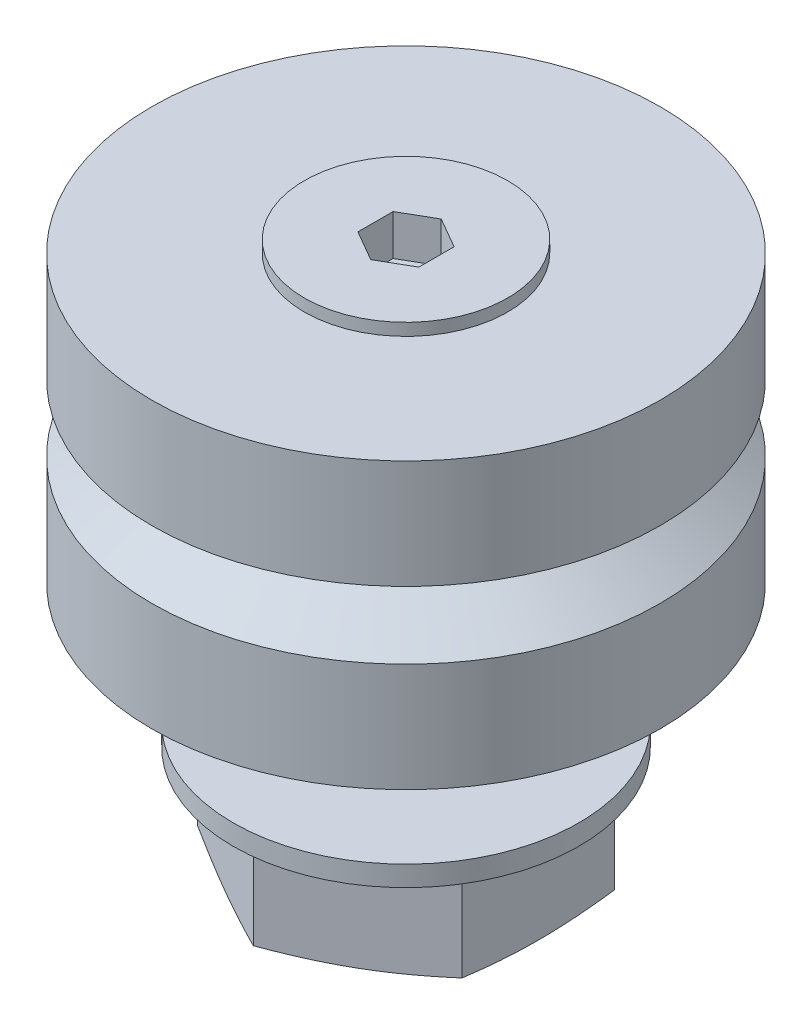
ISO-10303-21;
HEADER;
FILE_DESCRIPTION(('STEP AP214'),'2;1');
FILE_NAME('part.step','',(''),(''),'','','');
FILE_SCHEMA(('AUTOMOTIVE_DESIGN { 1 0 10303 214 1 1 1 1 }'));
ENDSEC;
DATA;
#1=APPLICATION_CONTEXT('core data for automotive mechanical design processes');
#2=APPLICATION_PROTOCOL_DEFINITION('international standard','automotive_design',2000,#1);
#3=PRODUCT_CONTEXT('',#1,'mechanical');
#4=PRODUCT('Part','Part','',(#3));
#5=PRODUCT_RELATED_PRODUCT_CATEGORY('part','',(#4));
#6=PRODUCT_DEFINITION_FORMATION('','',#4);
#7=PRODUCT_DEFINITION_CONTEXT('part definition',#1,'design');
#8=PRODUCT_DEFINITION('design','',#6,#7);
#9=PRODUCT_DEFINITION_SHAPE('','',#8);
#10=(LENGTH_UNIT() NAMED_UNIT(*) SI_UNIT(.MILLI.,.METRE.));
#11=(NAMED_UNIT(*) PLANE_ANGLE_UNIT() SI_UNIT($,.RADIAN.));
#12=(NAMED_UNIT(*) SI_UNIT($,.STERADIAN.) SOLID_ANGLE_UNIT());
#13=UNCERTAINTY_MEASURE_WITH_UNIT(LENGTH_MEASURE(1.E-05),#10,'distance_accuracy_value','');
#14=(GEOMETRIC_REPRESENTATION_CONTEXT(3) GLOBAL_UNCERTAINTY_ASSIGNED_CONTEXT((#13)) GLOBAL_UNIT_ASSIGNED_CONTEXT((#10,
#11,#12)) REPRESENTATION_CONTEXT('',''));
#15=CARTESIAN_POINT('',(0.,0.,0.));
#16=DIRECTION('',(0.,0.,1.));
#17=DIRECTION('',(1.,0.,0.));
#18=AXIS2_PLACEMENT_3D('',#15,#16,#17);
#19=CARTESIAN_POINT('',(-6.5,0.,3.7527767497326));
#20=DIRECTION('',(-1.,0.,0.));
#21=DIRECTION('',(0.,1.,0.));
#22=AXIS2_PLACEMENT_3D('',#19,#20,#21);
#23=PLANE('',#22);
#24=DIRECTION('',(0.,0.,-1.));
#25=VECTOR('',#24,1.);
#26=CARTESIAN_POINT('',(-6.5,2.,3.7527767497326));
#27=LINE('',#26,#25);
#28=CARTESIAN_POINT('',(-6.5,2.,-3.7527767497326));
#29=VERTEX_POINT('',#28);
#30=CARTESIAN_POINT('',(-6.5,2.,3.7527767497326));
#31=VERTEX_POINT('',#30);
#32=EDGE_CURVE('E162',#29,#31,#27,.F.);
#33=ORIENTED_EDGE('',*,*,#32,.F.);
#34=DIRECTION('',(0.,-1.,0.));
#35=VECTOR('',#34,1.);
#36=CARTESIAN_POINT('',(-6.5,2.,-3.7527767497326));
#37=LINE('',#36,#35);
#38=CARTESIAN_POINT('',(-6.5,0.,-3.7527767497326));
#39=VERTEX_POINT('',#38);
#40=EDGE_CURVE('E177',#29,#39,#37,.T.);
#41=ORIENTED_EDGE('',*,*,#40,.T.);
#42=DIRECTION('',(0.,0.,1.));
#43=VECTOR('',#42,1.);
#44=CARTESIAN_POINT('',(-6.5,0.,-3.7527767497326));
#45=LINE('',#44,#43);
#46=CARTESIAN_POINT('',(-6.5,0.,3.7527767497326));
#47=VERTEX_POINT('',#46);
#48=EDGE_CURVE('E183',#39,#47,#45,.T.);
#49=ORIENTED_EDGE('',*,*,#48,.T.);
#50=DIRECTION('',(0.,1.,0.));
#51=VECTOR('',#50,1.);
#52=CARTESIAN_POINT('',(-6.5,0.,3.7527767497326));
#53=LINE('',#52,#51);
#54=EDGE_CURVE('E179',#31,#47,#53,.F.);
#55=ORIENTED_EDGE('',*,*,#54,.F.);
#56=EDGE_LOOP('',(#33,#41,#49,#55));
#57=FACE_BOUND('',#56,.T.);
#58=ADVANCED_FACE('F17',(#57),#23,.T.);
#59=CARTESIAN_POINT('',(0.,0.,7.5055534994651));
#60=DIRECTION('',(-0.499999999999993,0.,0.866025403784443));
#61=DIRECTION('',(0.,1.,0.));
#62=AXIS2_PLACEMENT_3D('',#59,#60,#61);
#63=PLANE('',#62);
#64=DIRECTION('',(-0.866025403784443,0.,-0.499999999999993));
#65=VECTOR('',#64,1.);
#66=CARTESIAN_POINT('',(0.,2.,7.5055534994651));
#67=LINE('',#66,#65);
#68=CARTESIAN_POINT('',(0.,2.,7.5055534994651));
#69=VERTEX_POINT('',#68);
#70=EDGE_CURVE('E194',#31,#69,#67,.F.);
#71=ORIENTED_EDGE('',*,*,#70,.F.);
#72=ORIENTED_EDGE('',*,*,#54,.T.);
#73=DIRECTION('',(0.866025403784443,0.,0.499999999999993));
#74=VECTOR('',#73,1.);
#75=CARTESIAN_POINT('',(-6.5,0.,3.7527767497326));
#76=LINE('',#75,#74);
#77=CARTESIAN_POINT('',(0.,0.,7.5055534994651));
#78=VERTEX_POINT('',#77);
#79=EDGE_CURVE('E198',#47,#78,#76,.T.);
#80=ORIENTED_EDGE('',*,*,#79,.T.);
#81=DIRECTION('',(0.,1.,0.));
#82=VECTOR('',#81,1.);
#83=CARTESIAN_POINT('',(0.,0.,7.5055534994651));
#84=LINE('',#83,#82);
#85=EDGE_CURVE('E203',#69,#78,#84,.F.);
#86=ORIENTED_EDGE('',*,*,#85,.F.);
#87=EDGE_LOOP('',(#71,#72,#80,#86));
#88=FACE_BOUND('',#87,.T.);
#89=ADVANCED_FACE('F848',(#88),#63,.T.);
#90=CARTESIAN_POINT('',(6.5,0.,3.7527767497326));
#91=DIRECTION('',(0.499999999999993,0.,0.866025403784443));
#92=DIRECTION('',(0.,1.,0.));
#93=AXIS2_PLACEMENT_3D('',#90,#91,#92);
#94=PLANE('',#93);
#95=DIRECTION('',(-0.866025403784443,0.,0.499999999999993));
#96=VECTOR('',#95,1.);
#97=CARTESIAN_POINT('',(6.5,2.,3.7527767497326));
#98=LINE('',#97,#96);
#99=CARTESIAN_POINT('',(6.5,2.,3.7527767497326));
#100=VERTEX_POINT('',#99);
#101=EDGE_CURVE('E208',#69,#100,#98,.F.);
#102=ORIENTED_EDGE('',*,*,#101,.F.);
#103=ORIENTED_EDGE('',*,*,#85,.T.);
#104=DIRECTION('',(0.866025403784443,0.,-0.499999999999993));
#105=VECTOR('',#104,1.);
#106=CARTESIAN_POINT('',(0.,0.,7.5055534994651));
#107=LINE('',#106,#105);
#108=CARTESIAN_POINT('',(6.50000000000001,0.,3.7527767497326));
#109=VERTEX_POINT('',#108);
#110=EDGE_CURVE('E212',#78,#109,#107,.T.);
#111=ORIENTED_EDGE('',*,*,#110,.T.);
#112=DIRECTION('',(0.,1.,0.));
#113=VECTOR('',#112,1.);
#114=CARTESIAN_POINT('',(6.5,0.,3.7527767497326));
#115=LINE('',#114,#113);
#116=EDGE_CURVE('E217',#100,#109,#115,.F.);
#117=ORIENTED_EDGE('',*,*,#116,.F.);
#118=EDGE_LOOP('',(#102,#103,#111,#117));
#119=FACE_BOUND('',#118,.T.);
#120=ADVANCED_FACE('F853',(#119),#94,.T.);
#121=CARTESIAN_POINT('',(6.5,0.,-3.7527767497326));
#122=DIRECTION('',(1.,0.,0.));
#123=DIRECTION('',(0.,1.,0.));
#124=AXIS2_PLACEMENT_3D('',#121,#122,#123);
#125=PLANE('',#124);
#126=DIRECTION('',(0.,0.,1.));
#127=VECTOR('',#126,1.);
#128=CARTESIAN_POINT('',(6.5,2.,-3.7527767497326));
#129=LINE('',#128,#127);
#130=CARTESIAN_POINT('',(6.5,2.,-3.7527767497326));
#131=VERTEX_POINT('',#130);
#132=EDGE_CURVE('E222',#100,#131,#129,.F.);
#133=ORIENTED_EDGE('',*,*,#132,.F.);
#134=ORIENTED_EDGE('',*,*,#116,.T.);
#135=DIRECTION('',(0.,0.,-1.));
#136=VECTOR('',#135,1.);
#137=CARTESIAN_POINT('',(6.5,0.,3.7527767497326));
#138=LINE('',#137,#136);
#139=CARTESIAN_POINT('',(6.5,0.,-3.7527767497326));
#140=VERTEX_POINT('',#139);
#141=EDGE_CURVE('E226',#109,#140,#138,.T.);
#142=ORIENTED_EDGE('',*,*,#141,.T.);
#143=DIRECTION('',(0.,1.,0.));
#144=VECTOR('',#143,1.);
#145=CARTESIAN_POINT('',(6.5,0.,-3.7527767497326));
#146=LINE('',#145,#144);
#147=EDGE_CURVE('E231',#131,#140,#146,.F.);
#148=ORIENTED_EDGE('',*,*,#147,.F.);
#149=EDGE_LOOP('',(#133,#134,#142,#148));
#150=FACE_BOUND('',#149,.T.);
#151=ADVANCED_FACE('F859',(#150),#125,.T.);
#152=CARTESIAN_POINT('',(0.,0.,-7.5055534994651));
#153=DIRECTION('',(0.499999999999993,0.,-0.866025403784443));
#154=DIRECTION('',(0.,1.,0.));
#155=AXIS2_PLACEMENT_3D('',#152,#153,#154);
#156=PLANE('',#155);
#157=DIRECTION('',(0.866025403784443,0.,0.499999999999993));
#158=VECTOR('',#157,1.);
#159=CARTESIAN_POINT('',(0.,2.,-7.5055534994651));
#160=LINE('',#159,#158);
#161=CARTESIAN_POINT('',(0.,2.,-7.5055534994651));
#162=VERTEX_POINT('',#161);
#163=EDGE_CURVE('E165',#131,#162,#160,.F.);
#164=ORIENTED_EDGE('',*,*,#163,.F.);
#165=ORIENTED_EDGE('',*,*,#147,.T.);
#166=DIRECTION('',(-0.866025403784443,0.,-0.499999999999993));
#167=VECTOR('',#166,1.);
#168=CARTESIAN_POINT('',(6.5,0.,-3.7527767497326));
#169=LINE('',#168,#167);
#170=CARTESIAN_POINT('',(0.,0.,-7.5055534994651));
#171=VERTEX_POINT('',#170);
#172=EDGE_CURVE('E239',#140,#171,#169,.T.);
#173=ORIENTED_EDGE('',*,*,#172,.T.);
#174=DIRECTION('',(0.,1.,0.));
#175=VECTOR('',#174,1.);
#176=CARTESIAN_POINT('',(0.,0.,-7.5055534994651));
#177=LINE('',#176,#175);
#178=EDGE_CURVE('E171',#162,#171,#177,.F.);
#179=ORIENTED_EDGE('',*,*,#178,.F.);
#180=EDGE_LOOP('',(#164,#165,#173,#179));
#181=FACE_BOUND('',#180,.T.);
#182=ADVANCED_FACE('F863',(#181),#156,.T.);
#183=CARTESIAN_POINT('',(-6.5,0.,-3.7527767497326));
#184=DIRECTION('',(-0.499999999999993,0.,-0.866025403784443));
#185=DIRECTION('',(0.,1.,0.));
#186=AXIS2_PLACEMENT_3D('',#183,#184,#185);
#187=PLANE('',#186);
#188=DIRECTION('',(0.866025403784443,0.,-0.499999999999993));
#189=VECTOR('',#188,1.);
#190=CARTESIAN_POINT('',(-6.5,2.,-3.7527767497326));
#191=LINE('',#190,#189);
#192=EDGE_CURVE('E159',#162,#29,#191,.F.);
#193=ORIENTED_EDGE('',*,*,#192,.F.);
#194=ORIENTED_EDGE('',*,*,#178,.T.);
#195=DIRECTION('',(-0.866025403784443,0.,0.499999999999993));
#196=VECTOR('',#195,1.);
#197=CARTESIAN_POINT('',(0.,0.,-7.5055534994651));
#198=LINE('',#197,#196);
#199=EDGE_CURVE('E170',#171,#39,#198,.T.);
#200=ORIENTED_EDGE('',*,*,#199,.T.);
#201=ORIENTED_EDGE('',*,*,#40,.F.);
#202=EDGE_LOOP('',(#193,#194,#200,#201));
#203=FACE_BOUND('',#202,.T.);
#204=ADVANCED_FACE('F182',(#203),#187,.T.);
#205=CARTESIAN_POINT('',(-6.5,0.,-7.5055534994651));
#206=DIRECTION('',(0.,-1.,0.));
#207=DIRECTION('',(1.,0.,0.));
#208=AXIS2_PLACEMENT_3D('',#205,#206,#207);
#209=PLANE('',#208);
#210=ORIENTED_EDGE('',*,*,#48,.F.);
#211=ORIENTED_EDGE('',*,*,#199,.F.);
#212=ORIENTED_EDGE('',*,*,#172,.F.);
#213=ORIENTED_EDGE('',*,*,#141,.F.);
#214=ORIENTED_EDGE('',*,*,#110,.F.);
#215=ORIENTED_EDGE('',*,*,#79,.F.);
#216=EDGE_LOOP('',(#210,#211,#212,#213,#214,#215));
#217=FACE_BOUND('',#216,.T.);
#218=CARTESIAN_POINT('',(0.,0.,0.));
#219=DIRECTION('',(0.,1.,0.));
#220=DIRECTION('',(-1.4205389908817E-07,0.,-0.99999999999999));
#221=AXIS2_PLACEMENT_3D('',#218,#219,#220);
#222=CIRCLE('',#221,4.);
#223=CARTESIAN_POINT('',(-5.68215596352681E-07,0.,-3.99999999999996));
#224=VERTEX_POINT('',#223);
#225=EDGE_CURVE('E252',#224,#224,#222,.T.);
#226=ORIENTED_EDGE('',*,*,#225,.T.);
#227=EDGE_LOOP('',(#226));
#228=FACE_BOUND('',#227,.T.);
#229=ADVANCED_FACE('F870',(#217,#228),#209,.T.);
#230=CARTESIAN_POINT('',(-12.7322042750372,2.,-12.5));
#231=DIRECTION('',(0.,-1.,0.));
#232=DIRECTION('',(1.,0.,0.));
#233=AXIS2_PLACEMENT_3D('',#230,#231,#232);
#234=PLANE('',#233);
#235=CARTESIAN_POINT('',(0.,2.,0.));
#236=DIRECTION('',(0.,-1.,0.));
#237=DIRECTION('',(-1.16851708753529E-09,0.,1.));
#238=AXIS2_PLACEMENT_3D('',#235,#236,#237);
#239=CIRCLE('',#238,12.5);
#240=CARTESIAN_POINT('',(-1.46064635941911E-08,2.,12.5));
#241=VERTEX_POINT('',#240);
#242=EDGE_CURVE('E257',#241,#241,#239,.T.);
#243=ORIENTED_EDGE('',*,*,#242,.T.);
#244=EDGE_LOOP('',(#243));
#245=FACE_BOUND('',#244,.T.);
#246=ORIENTED_EDGE('',*,*,#132,.T.);
#247=ORIENTED_EDGE('',*,*,#163,.T.);
#248=ORIENTED_EDGE('',*,*,#192,.T.);
#249=ORIENTED_EDGE('',*,*,#32,.T.);
#250=ORIENTED_EDGE('',*,*,#70,.T.);
#251=ORIENTED_EDGE('',*,*,#101,.T.);
#252=EDGE_LOOP('',(#246,#247,#248,#249,#250,#251));
#253=FACE_BOUND('',#252,.T.);
#254=ADVANCED_FACE('F161',(#245,#253),#234,.T.);
#255=CARTESIAN_POINT('',(-5.,16.6,5.));
#256=DIRECTION('',(0.,1.,0.));
#257=DIRECTION('',(1.,0.,0.));
#258=AXIS2_PLACEMENT_3D('',#255,#256,#257);
#259=PLANE('',#258);
#260=CARTESIAN_POINT('',(0.,16.6,0.));
#261=DIRECTION('',(0.,1.,0.));
#262=DIRECTION('',(0.,0.,-1.));
#263=AXIS2_PLACEMENT_3D('',#260,#261,#262);
#264=CIRCLE('',#263,5.);
#265=CARTESIAN_POINT('',(0.,16.6,-5.));
#266=VERTEX_POINT('',#265);
#267=EDGE_CURVE('E260',#266,#266,#264,.F.);
#268=ORIENTED_EDGE('',*,*,#267,.F.);
#269=EDGE_LOOP('',(#268));
#270=FACE_BOUND('',#269,.T.);
#271=DIRECTION('',(-0.866025403784433,0.,0.500000000000009));
#272=VECTOR('',#271,1.);
#273=CARTESIAN_POINT('',(1.5,16.6,0.866025403784439));
#274=LINE('',#273,#272);
#275=CARTESIAN_POINT('',(0.,16.6,1.7320508075689));
#276=VERTEX_POINT('',#275);
#277=CARTESIAN_POINT('',(1.5,16.6,0.866025403784439));
#278=VERTEX_POINT('',#277);
#279=EDGE_CURVE('E263',#276,#278,#274,.F.);
#280=ORIENTED_EDGE('',*,*,#279,.F.);
#281=DIRECTION('',(-0.866025403784433,0.,-0.500000000000009));
#282=VECTOR('',#281,1.);
#283=CARTESIAN_POINT('',(0.,16.6,1.7320508075689));
#284=LINE('',#283,#282);
#285=CARTESIAN_POINT('',(-1.5,16.6,0.866025403784439));
#286=VERTEX_POINT('',#285);
#287=EDGE_CURVE('E266',#286,#276,#284,.F.);
#288=ORIENTED_EDGE('',*,*,#287,.F.);
#289=DIRECTION('',(0.,0.,-1.));
#290=VECTOR('',#289,1.);
#291=CARTESIAN_POINT('',(-1.5,16.6,0.866025403784439));
#292=LINE('',#291,#290);
#293=CARTESIAN_POINT('',(-1.5,16.6,-0.866025403784442));
#294=VERTEX_POINT('',#293);
#295=EDGE_CURVE('E271',#294,#286,#292,.F.);
#296=ORIENTED_EDGE('',*,*,#295,.F.);
#297=DIRECTION('',(0.866025403784434,0.,-0.500000000000008));
#298=VECTOR('',#297,1.);
#299=CARTESIAN_POINT('',(-1.5,16.6,-0.866025403784442));
#300=LINE('',#299,#298);
#301=CARTESIAN_POINT('',(0.,16.6,-1.7320508075689));
#302=VERTEX_POINT('',#301);
#303=EDGE_CURVE('E276',#302,#294,#300,.F.);
#304=ORIENTED_EDGE('',*,*,#303,.F.);
#305=DIRECTION('',(0.866025403784434,0.,0.500000000000008));
#306=VECTOR('',#305,1.);
#307=CARTESIAN_POINT('',(0.,16.6,-1.7320508075689));
#308=LINE('',#307,#306);
#309=CARTESIAN_POINT('',(1.5,16.6,-0.866025403784442));
#310=VERTEX_POINT('',#309);
#311=EDGE_CURVE('E280',#310,#302,#308,.F.);
#312=ORIENTED_EDGE('',*,*,#311,.F.);
#313=DIRECTION('',(0.,0.,1.));
#314=VECTOR('',#313,1.);
#315=CARTESIAN_POINT('',(1.5,16.6,-0.866025403784442));
#316=LINE('',#315,#314);
#317=EDGE_CURVE('E285',#310,#278,#316,.T.);
#318=ORIENTED_EDGE('',*,*,#317,.T.);
#319=EDGE_LOOP('',(#280,#288,#296,#304,#312,#318));
#320=FACE_BOUND('',#319,.T.);
#321=ADVANCED_FACE('F795',(#270,#320),#259,.T.);
#322=CARTESIAN_POINT('',(-12.7322042967848,16.,12.5));
#323=DIRECTION('',(0.,1.,0.));
#324=DIRECTION('',(1.,0.,0.));
#325=AXIS2_PLACEMENT_3D('',#322,#323,#324);
#326=PLANE('',#325);
#327=CARTESIAN_POINT('',(0.,16.,0.));
#328=DIRECTION('',(0.,1.,0.));
#329=DIRECTION('',(0.,0.,-1.));
#330=AXIS2_PLACEMENT_3D('',#327,#328,#329);
#331=CIRCLE('',#330,12.5);
#332=CARTESIAN_POINT('',(0.,16.,-12.5));
#333=VERTEX_POINT('',#332);
#334=EDGE_CURVE('E290',#333,#333,#331,.F.);
#335=ORIENTED_EDGE('',*,*,#334,.F.);
#336=EDGE_LOOP('',(#335));
#337=FACE_BOUND('',#336,.T.);
#338=CARTESIAN_POINT('',(0.,16.,0.));
#339=DIRECTION('',(0.,-1.,0.));
#340=DIRECTION('',(-1.42053902507657E-07,0.,0.99999999999999));
#341=AXIS2_PLACEMENT_3D('',#338,#339,#340);
#342=CIRCLE('',#341,5.);
#343=CARTESIAN_POINT('',(-7.10269512538286E-07,16.,4.99999999999995));
#344=VERTEX_POINT('',#343);
#345=EDGE_CURVE('E295',#344,#344,#342,.T.);
#346=ORIENTED_EDGE('',*,*,#345,.T.);
#347=EDGE_LOOP('',(#346));
#348=FACE_BOUND('',#347,.T.);
#349=ADVANCED_FACE('F791',(#337,#348),#326,.T.);
#350=CARTESIAN_POINT('',(-1.5,14.6,-0.866025403784441));
#351=DIRECTION('',(1.,0.,0.));
#352=DIRECTION('',(0.,1.,0.));
#353=AXIS2_PLACEMENT_3D('',#350,#351,#352);
#354=PLANE('',#353);
#355=ORIENTED_EDGE('',*,*,#295,.T.);
#356=DIRECTION('',(0.,-1.,0.));
#357=VECTOR('',#356,1.);
#358=CARTESIAN_POINT('',(-1.5,16.6,0.86602540378444));
#359=LINE('',#358,#357);
#360=CARTESIAN_POINT('',(-1.5,14.6,0.86602540378444));
#361=VERTEX_POINT('',#360);
#362=EDGE_CURVE('E298',#361,#286,#359,.F.);
#363=ORIENTED_EDGE('',*,*,#362,.F.);
#364=DIRECTION('',(0.,0.,-1.));
#365=VECTOR('',#364,1.);
#366=CARTESIAN_POINT('',(-1.5,14.6,0.86602540378444));
#367=LINE('',#366,#365);
#368=CARTESIAN_POINT('',(-1.5,14.6,-0.866025403784441));
#369=VERTEX_POINT('',#368);
#370=EDGE_CURVE('E300',#369,#361,#367,.F.);
#371=ORIENTED_EDGE('',*,*,#370,.F.);
#372=DIRECTION('',(0.,1.,0.));
#373=VECTOR('',#372,1.);
#374=CARTESIAN_POINT('',(-1.5,14.6,-0.866025403784441));
#375=LINE('',#374,#373);
#376=EDGE_CURVE('E304',#369,#294,#375,.T.);
#377=ORIENTED_EDGE('',*,*,#376,.T.);
#378=EDGE_LOOP('',(#355,#363,#371,#377));
#379=FACE_BOUND('',#378,.T.);
#380=ADVANCED_FACE('F794',(#379),#354,.T.);
#381=CARTESIAN_POINT('',(-1.5,14.6,0.86602540378444));
#382=DIRECTION('',(0.500000000000009,0.,-0.866025403784434));
#383=DIRECTION('',(0.,1.,0.));
#384=AXIS2_PLACEMENT_3D('',#381,#382,#383);
#385=PLANE('',#384);
#386=ORIENTED_EDGE('',*,*,#287,.T.);
#387=DIRECTION('',(0.,-1.,0.));
#388=VECTOR('',#387,1.);
#389=CARTESIAN_POINT('',(0.,16.6,1.7320508075689));
#390=LINE('',#389,#388);
#391=CARTESIAN_POINT('',(0.,14.6,1.7320508075689));
#392=VERTEX_POINT('',#391);
#393=EDGE_CURVE('E309',#392,#276,#390,.F.);
#394=ORIENTED_EDGE('',*,*,#393,.F.);
#395=DIRECTION('',(-0.866025403784434,0.,-0.500000000000009));
#396=VECTOR('',#395,1.);
#397=CARTESIAN_POINT('',(0.,14.6,1.7320508075689));
#398=LINE('',#397,#396);
#399=EDGE_CURVE('E313',#361,#392,#398,.F.);
#400=ORIENTED_EDGE('',*,*,#399,.F.);
#401=ORIENTED_EDGE('',*,*,#362,.T.);
#402=EDGE_LOOP('',(#386,#394,#400,#401));
#403=FACE_BOUND('',#402,.T.);
#404=ADVANCED_FACE('F815',(#403),#385,.T.);
#405=CARTESIAN_POINT('',(0.,14.6,1.7320508075689));
#406=DIRECTION('',(-0.500000000000009,0.,-0.866025403784434));
#407=DIRECTION('',(0.,1.,0.));
#408=AXIS2_PLACEMENT_3D('',#405,#406,#407);
#409=PLANE('',#408);
#410=ORIENTED_EDGE('',*,*,#279,.T.);
#411=DIRECTION('',(0.,-1.,0.));
#412=VECTOR('',#411,1.);
#413=CARTESIAN_POINT('',(1.5,16.6,0.866025403784441));
#414=LINE('',#413,#412);
#415=CARTESIAN_POINT('',(1.5,14.6,0.866025403784441));
#416=VERTEX_POINT('',#415);
#417=EDGE_CURVE('E317',#416,#278,#414,.F.);
#418=ORIENTED_EDGE('',*,*,#417,.F.);
#419=DIRECTION('',(-0.866025403784434,0.,0.500000000000009));
#420=VECTOR('',#419,1.);
#421=CARTESIAN_POINT('',(1.5,14.6,0.866025403784441));
#422=LINE('',#421,#420);
#423=EDGE_CURVE('E321',#392,#416,#422,.F.);
#424=ORIENTED_EDGE('',*,*,#423,.F.);
#425=ORIENTED_EDGE('',*,*,#393,.T.);
#426=EDGE_LOOP('',(#410,#418,#424,#425));
#427=FACE_BOUND('',#426,.T.);
#428=ADVANCED_FACE('F832',(#427),#409,.T.);
#429=CARTESIAN_POINT('',(1.5,14.6,0.86602540378444));
#430=DIRECTION('',(-1.,0.,0.));
#431=DIRECTION('',(0.,1.,0.));
#432=AXIS2_PLACEMENT_3D('',#429,#430,#431);
#433=PLANE('',#432);
#434=ORIENTED_EDGE('',*,*,#417,.T.);
#435=ORIENTED_EDGE('',*,*,#317,.F.);
#436=DIRECTION('',(0.,-1.,0.));
#437=VECTOR('',#436,1.);
#438=CARTESIAN_POINT('',(1.5,16.6,-0.866025403784441));
#439=LINE('',#438,#437);
#440=CARTESIAN_POINT('',(1.5,14.6,-0.866025403784441));
#441=VERTEX_POINT('',#440);
#442=EDGE_CURVE('E325',#441,#310,#439,.F.);
#443=ORIENTED_EDGE('',*,*,#442,.F.);
#444=DIRECTION('',(0.,0.,1.));
#445=VECTOR('',#444,1.);
#446=CARTESIAN_POINT('',(1.5,14.6,-0.866025403784441));
#447=LINE('',#446,#445);
#448=EDGE_CURVE('E329',#416,#441,#447,.F.);
#449=ORIENTED_EDGE('',*,*,#448,.F.);
#450=EDGE_LOOP('',(#434,#435,#443,#449));
#451=FACE_BOUND('',#450,.T.);
#452=ADVANCED_FACE('F830',(#451),#433,.T.);
#453=CARTESIAN_POINT('',(1.5,14.6,-0.86602540378444));
#454=DIRECTION('',(-0.500000000000009,0.,0.866025403784434));
#455=DIRECTION('',(0.,1.,0.));
#456=AXIS2_PLACEMENT_3D('',#453,#454,#455);
#457=PLANE('',#456);
#458=ORIENTED_EDGE('',*,*,#311,.T.);
#459=DIRECTION('',(0.,-1.,0.));
#460=VECTOR('',#459,1.);
#461=CARTESIAN_POINT('',(0.,16.6,-1.7320508075689));
#462=LINE('',#461,#460);
#463=CARTESIAN_POINT('',(0.,14.6,-1.7320508075689));
#464=VERTEX_POINT('',#463);
#465=EDGE_CURVE('E333',#464,#302,#462,.F.);
#466=ORIENTED_EDGE('',*,*,#465,.F.);
#467=DIRECTION('',(0.866025403784434,0.,0.500000000000009));
#468=VECTOR('',#467,1.);
#469=CARTESIAN_POINT('',(0.,14.6,-1.7320508075689));
#470=LINE('',#469,#468);
#471=EDGE_CURVE('E337',#441,#464,#470,.F.);
#472=ORIENTED_EDGE('',*,*,#471,.F.);
#473=ORIENTED_EDGE('',*,*,#442,.T.);
#474=EDGE_LOOP('',(#458,#466,#472,#473));
#475=FACE_BOUND('',#474,.T.);
#476=ADVANCED_FACE('F825',(#475),#457,.T.);
#477=CARTESIAN_POINT('',(0.,14.6,-1.7320508075689));
#478=DIRECTION('',(0.500000000000009,0.,0.866025403784434));
#479=DIRECTION('',(0.,1.,0.));
#480=AXIS2_PLACEMENT_3D('',#477,#478,#479);
#481=PLANE('',#480);
#482=ORIENTED_EDGE('',*,*,#303,.T.);
#483=ORIENTED_EDGE('',*,*,#376,.F.);
#484=DIRECTION('',(0.866025403784434,0.,-0.500000000000009));
#485=VECTOR('',#484,1.);
#486=CARTESIAN_POINT('',(-1.5,14.6,-0.866025403784441));
#487=LINE('',#486,#485);
#488=EDGE_CURVE('E341',#464,#369,#487,.F.);
#489=ORIENTED_EDGE('',*,*,#488,.F.);
#490=ORIENTED_EDGE('',*,*,#465,.T.);
#491=EDGE_LOOP('',(#482,#483,#489,#490));
#492=FACE_BOUND('',#491,.T.);
#493=ADVANCED_FACE('F836',(#492),#481,.T.);
#494=CARTESIAN_POINT('',(-1.5,14.6,-1.7320508075689));
#495=DIRECTION('',(0.,1.,0.));
#496=DIRECTION('',(0.,0.,1.));
#497=AXIS2_PLACEMENT_3D('',#494,#495,#496);
#498=PLANE('',#497);
#499=ORIENTED_EDGE('',*,*,#370,.T.);
#500=ORIENTED_EDGE('',*,*,#399,.T.);
#501=ORIENTED_EDGE('',*,*,#423,.T.);
#502=ORIENTED_EDGE('',*,*,#448,.T.);
#503=ORIENTED_EDGE('',*,*,#471,.T.);
#504=ORIENTED_EDGE('',*,*,#488,.T.);
#505=EDGE_LOOP('',(#499,#500,#501,#502,#503,#504));
#506=FACE_BOUND('',#505,.T.);
#507=ADVANCED_FACE('F834',(#506),#498,.T.);
#508=CARTESIAN_POINT('',(-8.73225364009987,-4.,8.5));
#509=DIRECTION('',(0.,1.,0.));
#510=DIRECTION('',(1.,0.,0.));
#511=AXIS2_PLACEMENT_3D('',#508,#509,#510);
#512=PLANE('',#511);
#513=CARTESIAN_POINT('',(0.,-4.,0.));
#514=DIRECTION('',(0.,1.,0.));
#515=DIRECTION('',(0.,0.,-1.));
#516=AXIS2_PLACEMENT_3D('',#513,#514,#515);
#517=CIRCLE('',#516,8.5);
#518=CARTESIAN_POINT('',(0.,-4.,-8.5));
#519=VERTEX_POINT('',#518);
#520=EDGE_CURVE('E345',#519,#519,#517,.F.);
#521=ORIENTED_EDGE('',*,*,#520,.F.);
#522=EDGE_LOOP('',(#521));
#523=FACE_BOUND('',#522,.T.);
#524=CARTESIAN_POINT('',(0.,-4.,0.));
#525=DIRECTION('',(0.,-1.,0.));
#526=DIRECTION('',(0.,0.,1.));
#527=AXIS2_PLACEMENT_3D('',#524,#525,#526);
#528=CIRCLE('',#527,4.);
#529=CARTESIAN_POINT('',(0.,-4.,4.));
#530=VERTEX_POINT('',#529);
#531=EDGE_CURVE('E350',#530,#530,#528,.T.);
#532=ORIENTED_EDGE('',*,*,#531,.T.);
#533=EDGE_LOOP('',(#532));
#534=FACE_BOUND('',#533,.T.);
#535=ADVANCED_FACE('F844',(#523,#534),#512,.T.);
#536=CARTESIAN_POINT('',(-8.73225362560406,-5.,-8.5));
#537=DIRECTION('',(0.,-1.,0.));
#538=DIRECTION('',(1.,0.,0.));
#539=AXIS2_PLACEMENT_3D('',#536,#537,#538);
#540=PLANE('',#539);
#541=CARTESIAN_POINT('',(0.,-5.,0.));
#542=DIRECTION('',(0.,-1.,0.));
#543=DIRECTION('',(-1.16842149027969E-09,0.,1.));
#544=AXIS2_PLACEMENT_3D('',#541,#542,#543);
#545=CIRCLE('',#544,8.5);
#546=CARTESIAN_POINT('',(-9.93158266737737E-09,-5.,8.5));
#547=VERTEX_POINT('',#546);
#548=EDGE_CURVE('E353',#547,#547,#545,.F.);
#549=ORIENTED_EDGE('',*,*,#548,.F.);
#550=EDGE_LOOP('',(#549));
#551=FACE_BOUND('',#550,.T.);
#552=DIRECTION('',(0.,0.,1.));
#553=VECTOR('',#552,1.);
#554=CARTESIAN_POINT('',(-6.5,-5.,-3.7527767497326));
#555=LINE('',#554,#553);
#556=CARTESIAN_POINT('',(-6.5,-5.,-3.7527767497326));
#557=VERTEX_POINT('',#556);
#558=CARTESIAN_POINT('',(-6.5,-5.,3.7527767497326));
#559=VERTEX_POINT('',#558);
#560=EDGE_CURVE('E356',#557,#559,#555,.T.);
#561=ORIENTED_EDGE('',*,*,#560,.T.);
#562=DIRECTION('',(0.866025403784443,0.,0.499999999999993));
#563=VECTOR('',#562,1.);
#564=CARTESIAN_POINT('',(-6.5,-5.,3.7527767497326));
#565=LINE('',#564,#563);
#566=CARTESIAN_POINT('',(0.,-5.,7.5055534994651));
#567=VERTEX_POINT('',#566);
#568=EDGE_CURVE('E359',#559,#567,#565,.T.);
#569=ORIENTED_EDGE('',*,*,#568,.T.);
#570=DIRECTION('',(0.866025403784443,0.,-0.499999999999993));
#571=VECTOR('',#570,1.);
#572=CARTESIAN_POINT('',(0.,-5.,7.5055534994651));
#573=LINE('',#572,#571);
#574=CARTESIAN_POINT('',(6.5,-5.,3.75277674973261));
#575=VERTEX_POINT('',#574);
#576=EDGE_CURVE('E364',#567,#575,#573,.T.);
#577=ORIENTED_EDGE('',*,*,#576,.T.);
#578=DIRECTION('',(0.,0.,-1.));
#579=VECTOR('',#578,1.);
#580=CARTESIAN_POINT('',(6.5,-5.,3.7527767497326));
#581=LINE('',#580,#579);
#582=CARTESIAN_POINT('',(6.5,-5.,-3.7527767497326));
#583=VERTEX_POINT('',#582);
#584=EDGE_CURVE('E369',#575,#583,#581,.T.);
#585=ORIENTED_EDGE('',*,*,#584,.T.);
#586=DIRECTION('',(-0.866025403784443,0.,-0.499999999999993));
#587=VECTOR('',#586,1.);
#588=CARTESIAN_POINT('',(6.5,-5.,-3.7527767497326));
#589=LINE('',#588,#587);
#590=CARTESIAN_POINT('',(0.,-5.,-7.5055534994651));
#591=VERTEX_POINT('',#590);
#592=EDGE_CURVE('E374',#583,#591,#589,.T.);
#593=ORIENTED_EDGE('',*,*,#592,.T.);
#594=DIRECTION('',(-0.866025403784443,0.,0.499999999999993));
#595=VECTOR('',#594,1.);
#596=CARTESIAN_POINT('',(0.,-5.,-7.5055534994651));
#597=LINE('',#596,#595);
#598=EDGE_CURVE('E379',#591,#557,#597,.T.);
#599=ORIENTED_EDGE('',*,*,#598,.T.);
#600=EDGE_LOOP('',(#561,#569,#577,#585,#593,#599));
#601=FACE_BOUND('',#600,.T.);
#602=ADVANCED_FACE('F409',(#551,#601),#540,.T.);
#603=CARTESIAN_POINT('',(-6.5,-10.0000003259056,-3.7527767497326));
#604=DIRECTION('',(-1.,0.,0.));
#605=DIRECTION('',(0.,0.,1.));
#606=AXIS2_PLACEMENT_3D('',#603,#604,#605);
#607=PLANE('',#606);
#608=CARTESIAN_POINT('',(-6.5,-9.73056275197262,-3.75277674925733));
#609=CARTESIAN_POINT('',(-6.5,-9.89856361489814,-2.49880070907649));
#610=CARTESIAN_POINT('',(-6.5,-9.99999967149884,-1.27548900278674));
#611=CARTESIAN_POINT('',(-6.5,-9.99999999999957,-4.68512544775715E-06));
#612=B_SPLINE_CURVE_WITH_KNOTS('',3,(#608,#609,#610,#611),.UNSPECIFIED.,.F.,.F.,(4,4),(0.,1.),.UNSPECIFIED.);
#613=CARTESIAN_POINT('',(-6.5,-9.73056275197262,-3.75277674925733));
#614=VERTEX_POINT('',#613);
#615=CARTESIAN_POINT('',(-6.49999999999831,-10.,-4.68512544771205E-06));
#616=VERTEX_POINT('',#615);
#617=EDGE_CURVE('E384',#614,#616,#612,.T.);
#618=ORIENTED_EDGE('',*,*,#617,.T.);
#619=CARTESIAN_POINT('',(-6.5,-9.99999999999957,-4.68512544775715E-06));
#620=CARTESIAN_POINT('',(-6.5,-10.0000002347558,1.26603162437417));
#621=CARTESIAN_POINT('',(-6.5,-9.90014320283263,2.48701096928203));
#622=CARTESIAN_POINT('',(-6.5,-9.73056275763246,3.75277670673634));
#623=B_SPLINE_CURVE_WITH_KNOTS('',3,(#619,#620,#621,#622),.UNSPECIFIED.,.F.,.F.,(4,4),(0.,1.),.UNSPECIFIED.);
#624=CARTESIAN_POINT('',(-6.5,-9.73056275763246,3.75277670673634));
#625=VERTEX_POINT('',#624);
#626=EDGE_CURVE('E426',#616,#625,#623,.T.);
#627=ORIENTED_EDGE('',*,*,#626,.T.);
#628=DIRECTION('',(0.,1.,9.08903774062376E-09));
#629=VECTOR('',#628,1.);
#630=CARTESIAN_POINT('',(-6.5,-9.73056275763246,3.75277670673634));
#631=LINE('',#630,#629);
#632=EDGE_CURVE('E417',#625,#559,#631,.T.);
#633=ORIENTED_EDGE('',*,*,#632,.T.);
#634=ORIENTED_EDGE('',*,*,#560,.F.);
#635=DIRECTION('',(0.,-1.,1.00468816769414E-10));
#636=VECTOR('',#635,1.);
#637=CARTESIAN_POINT('',(-6.5,-5.,-3.7527767497326));
#638=LINE('',#637,#636);
#639=EDGE_CURVE('E425',#614,#557,#638,.F.);
#640=ORIENTED_EDGE('',*,*,#639,.F.);
#641=EDGE_LOOP('',(#618,#627,#633,#634,#640));
#642=FACE_BOUND('',#641,.T.);
#643=ADVANCED_FACE('F398',(#642),#607,.T.);
#644=CARTESIAN_POINT('',(2.35751927780509E-12,-10.000000000035,-7.50555349946646));
#645=DIRECTION('',(-0.499999999999993,0.,-0.866025403784443));
#646=DIRECTION('',(-0.866025403784443,0.,0.499999999999993));
#647=AXIS2_PLACEMENT_3D('',#644,#645,#646);
#648=PLANE('',#647);
#649=CARTESIAN_POINT('',(5.87106982440012E-13,-9.7305627518706,-7.50555349946544));
#650=CARTESIAN_POINT('',(-1.09540319644268,-9.90002221610423,-6.87312216912776));
#651=CARTESIAN_POINT('',(-2.15292758260696,-10.0000000000009,-6.26256018010123));
#652=CARTESIAN_POINT('',(-3.24999999999995,-10.,-5.62916512459888));
#653=B_SPLINE_CURVE_WITH_KNOTS('',3,(#649,#650,#651,#652),.UNSPECIFIED.,.F.,.F.,(4,4),(0.,1.),.UNSPECIFIED.);
#654=CARTESIAN_POINT('',(5.87106982440012E-13,-9.7305627518706,-7.50555349946544));
#655=VERTEX_POINT('',#654);
#656=CARTESIAN_POINT('',(-3.24999999999996,-10.,-5.62916512459888));
#657=VERTEX_POINT('',#656);
#658=EDGE_CURVE('E430',#655,#657,#653,.T.);
#659=ORIENTED_EDGE('',*,*,#658,.T.);
#660=CARTESIAN_POINT('',(-3.24999999999995,-10.,-5.62916512459888));
#661=CARTESIAN_POINT('',(-4.34707241750327,-10.000000000035,-4.99577006903284));
#662=CARTESIAN_POINT('',(-5.40459680377474,-9.9000222161715,-4.38520807994442));
#663=CARTESIAN_POINT('',(-6.50000000033034,-9.73056275197262,-3.75277674954188));
#664=B_SPLINE_CURVE_WITH_KNOTS('',3,(#660,#661,#662,#663),.UNSPECIFIED.,.F.,.F.,(4,4),(0.,1.),.UNSPECIFIED.);
#665=EDGE_CURVE('E448',#657,#614,#664,.T.);
#666=ORIENTED_EDGE('',*,*,#665,.T.);
#667=ORIENTED_EDGE('',*,*,#639,.T.);
#668=ORIENTED_EDGE('',*,*,#598,.F.);
#669=DIRECTION('',(1.24059863701912E-13,-1.,0.));
#670=VECTOR('',#669,1.);
#671=CARTESIAN_POINT('',(0.,-5.,-7.5055534994651));
#672=LINE('',#671,#670);
#673=EDGE_CURVE('E452',#655,#591,#672,.F.);
#674=ORIENTED_EDGE('',*,*,#673,.F.);
#675=EDGE_LOOP('',(#659,#666,#667,#668,#674));
#676=FACE_BOUND('',#675,.T.);
#677=ADVANCED_FACE('F408',(#676),#648,.T.);
#678=CARTESIAN_POINT('',(6.50000001862265,-10.0000000019279,-3.75277673898081));
#679=DIRECTION('',(0.499999999999993,0.,-0.866025403784443));
#680=DIRECTION('',(-0.866025403784443,0.,-0.499999999999993));
#681=AXIS2_PLACEMENT_3D('',#678,#679,#680);
#682=PLANE('',#681);
#683=CARTESIAN_POINT('',(6.50000001862088,-9.73056275763173,-3.75277673898183));
#684=CARTESIAN_POINT('',(5.40459681583434,-9.90002221990277,-4.3852080729818));
#685=CARTESIAN_POINT('',(4.34707242362118,-10.0000000019279,-4.99577006550065));
#686=CARTESIAN_POINT('',(3.24999999999995,-10.,-5.62916512459888));
#687=B_SPLINE_CURVE_WITH_KNOTS('',3,(#683,#684,#685,#686),.UNSPECIFIED.,.F.,.F.,(4,4),(0.,1.),.UNSPECIFIED.);
#688=CARTESIAN_POINT('',(6.50000001862088,-9.73056275763173,-3.75277673898183));
#689=VERTEX_POINT('',#688);
#690=CARTESIAN_POINT('',(3.24999999999996,-10.,-5.62916512459888));
#691=VERTEX_POINT('',#690);
#692=EDGE_CURVE('E459',#689,#691,#687,.T.);
#693=ORIENTED_EDGE('',*,*,#692,.T.);
#694=CARTESIAN_POINT('',(3.24999999999995,-10.,-5.62916512459888));
#695=CARTESIAN_POINT('',(2.15292758260697,-10.0000000000009,-6.26256018010122));
#696=CARTESIAN_POINT('',(1.09540319644265,-9.90002221610423,-6.87312216912777));
#697=CARTESIAN_POINT('',(-5.93275428784068E-13,-9.7305627518706,-7.50555349946544));
#698=B_SPLINE_CURVE_WITH_KNOTS('',3,(#694,#695,#696,#697),.UNSPECIFIED.,.F.,.F.,(4,4),(0.,1.),.UNSPECIFIED.);
#699=EDGE_CURVE('E496',#691,#655,#698,.T.);
#700=ORIENTED_EDGE('',*,*,#699,.T.);
#701=ORIENTED_EDGE('',*,*,#673,.T.);
#702=ORIENTED_EDGE('',*,*,#592,.F.);
#703=DIRECTION('',(3.93629257552152E-09,-1.,2.27261949890592E-09));
#704=VECTOR('',#703,1.);
#705=CARTESIAN_POINT('',(6.5,-5.,-3.7527767497326));
#706=LINE('',#705,#704);
#707=EDGE_CURVE('E488',#689,#583,#706,.F.);
#708=ORIENTED_EDGE('',*,*,#707,.F.);
#709=EDGE_LOOP('',(#693,#700,#701,#702,#708));
#710=FACE_BOUND('',#709,.T.);
#711=ADVANCED_FACE('F472',(#710),#682,.T.);
#712=CARTESIAN_POINT('',(6.5,-10.0000003259056,3.7527767497326));
#713=DIRECTION('',(1.,0.,0.));
#714=DIRECTION('',(0.,0.,-1.));
#715=AXIS2_PLACEMENT_3D('',#712,#713,#714);
#716=PLANE('',#715);
#717=CARTESIAN_POINT('',(6.5,-9.73056275197262,3.75277674925733));
#718=CARTESIAN_POINT('',(6.5,-9.89856361489815,2.49880070915187));
#719=CARTESIAN_POINT('',(6.5,-9.99999967149884,1.27548900293481));
#720=CARTESIAN_POINT('',(6.5,-9.99999999999957,4.68534869712753E-06));
#721=B_SPLINE_CURVE_WITH_KNOTS('',3,(#717,#718,#719,#720),.UNSPECIFIED.,.F.,.F.,(4,4),(0.,1.),.UNSPECIFIED.);
#722=CARTESIAN_POINT('',(6.5,-9.73056275197262,3.75277674925733));
#723=VERTEX_POINT('',#722);
#724=CARTESIAN_POINT('',(6.49999999999832,-10.,4.68534869713039E-06));
#725=VERTEX_POINT('',#724);
#726=EDGE_CURVE('E495',#723,#725,#721,.T.);
#727=ORIENTED_EDGE('',*,*,#726,.T.);
#728=CARTESIAN_POINT('',(6.5,-9.99999999999957,4.68534869712753E-06));
#729=CARTESIAN_POINT('',(6.5,-10.0000002347673,-1.26603162961962));
#730=CARTESIAN_POINT('',(6.5,-9.90014320284211,-2.4870109798328));
#731=CARTESIAN_POINT('',(6.5,-9.73056275763173,-3.75277672285721));
#732=B_SPLINE_CURVE_WITH_KNOTS('',3,(#728,#729,#730,#731),.UNSPECIFIED.,.F.,.F.,(4,4),(0.,1.),.UNSPECIFIED.);
#733=EDGE_CURVE('E514',#725,#689,#732,.T.);
#734=ORIENTED_EDGE('',*,*,#733,.T.);
#735=ORIENTED_EDGE('',*,*,#707,.T.);
#736=ORIENTED_EDGE('',*,*,#584,.F.);
#737=DIRECTION('',(0.,-1.,-1.00468722892801E-10));
#738=VECTOR('',#737,1.);
#739=CARTESIAN_POINT('',(6.5,-5.,3.7527767497326));
#740=LINE('',#739,#738);
#741=EDGE_CURVE('E518',#723,#575,#740,.F.);
#742=ORIENTED_EDGE('',*,*,#741,.F.);
#743=EDGE_LOOP('',(#727,#734,#735,#736,#742));
#744=FACE_BOUND('',#743,.T.);
#745=ADVANCED_FACE('F481',(#744),#716,.T.);
#746=CARTESIAN_POINT('',(-2.35892997885297E-12,-10.000000000035,7.50555349946646));
#747=DIRECTION('',(0.499999999999993,0.,0.866025403784443));
#748=DIRECTION('',(0.866025403784443,0.,-0.499999999999993));
#749=AXIS2_PLACEMENT_3D('',#746,#747,#748);
#750=PLANE('',#749);
#751=CARTESIAN_POINT('',(-5.88603278779821E-13,-9.7305627518706,7.50555349946544));
#752=CARTESIAN_POINT('',(1.09540319644264,-9.90002221610423,6.87312216912778));
#753=CARTESIAN_POINT('',(2.15292758260698,-10.0000000000009,6.26256018010121));
#754=CARTESIAN_POINT('',(3.24999999999996,-10.,5.62916512459888));
#755=B_SPLINE_CURVE_WITH_KNOTS('',3,(#751,#752,#753,#754),.UNSPECIFIED.,.F.,.F.,(4,4),(0.,1.),.UNSPECIFIED.);
#756=CARTESIAN_POINT('',(-5.88603278779821E-13,-9.7305627518706,7.50555349946544));
#757=VERTEX_POINT('',#756);
#758=CARTESIAN_POINT('',(3.24999999999996,-10.,5.62916512459888));
#759=VERTEX_POINT('',#758);
#760=EDGE_CURVE('E37',#757,#759,#755,.T.);
#761=ORIENTED_EDGE('',*,*,#760,.T.);
#762=CARTESIAN_POINT('',(3.24999999999996,-10.,5.62916512459888));
#763=CARTESIAN_POINT('',(4.34707241750328,-10.000000000035,4.99577006903283));
#764=CARTESIAN_POINT('',(5.4045968037747,-9.9000222161715,4.38520807994444));
#765=CARTESIAN_POINT('',(6.50000000033034,-9.73056275197262,3.75277674954188));
#766=B_SPLINE_CURVE_WITH_KNOTS('',3,(#762,#763,#764,#765),.UNSPECIFIED.,.F.,.F.,(4,4),(0.,1.),.UNSPECIFIED.);
#767=EDGE_CURVE('E560',#759,#723,#766,.T.);
#768=ORIENTED_EDGE('',*,*,#767,.T.);
#769=ORIENTED_EDGE('',*,*,#741,.T.);
#770=ORIENTED_EDGE('',*,*,#576,.F.);
#771=DIRECTION('',(-1.2440183683098E-13,-1.,0.));
#772=VECTOR('',#771,1.);
#773=CARTESIAN_POINT('',(0.,-5.,7.5055534994651));
#774=LINE('',#773,#772);
#775=EDGE_CURVE('E552',#757,#567,#774,.F.);
#776=ORIENTED_EDGE('',*,*,#775,.F.);
#777=EDGE_LOOP('',(#761,#768,#769,#770,#776));
#778=FACE_BOUND('',#777,.T.);
#779=ADVANCED_FACE('F536',(#778),#750,.T.);
#780=CARTESIAN_POINT('',(-6.50000001861793,-10.0000000019282,3.75277673898354));
#781=DIRECTION('',(-0.499999999999993,0.,0.866025403784443));
#782=DIRECTION('',(0.866025403784443,0.,0.499999999999993));
#783=AXIS2_PLACEMENT_3D('',#780,#781,#782);
#784=PLANE('',#783);
#785=CARTESIAN_POINT('',(-6.50000001861793,-9.73056275763246,3.75277673898354));
#786=CARTESIAN_POINT('',(-5.4045968158324,-9.90002221990325,4.38520807298293));
#787=CARTESIAN_POINT('',(-4.3470724236202,-10.0000000019282,4.99577006550123));
#788=CARTESIAN_POINT('',(-3.24999999999996,-10.,5.62916512459887));
#789=B_SPLINE_CURVE_WITH_KNOTS('',3,(#785,#786,#787,#788),.UNSPECIFIED.,.F.,.F.,(4,4),(0.,1.),.UNSPECIFIED.);
#790=CARTESIAN_POINT('',(-3.24999999999996,-10.,5.62916512459888));
#791=VERTEX_POINT('',#790);
#792=EDGE_CURVE('E559',#625,#791,#789,.T.);
#793=ORIENTED_EDGE('',*,*,#792,.T.);
#794=CARTESIAN_POINT('',(-3.24999999999996,-10.,5.62916512459887));
#795=CARTESIAN_POINT('',(-2.15292758260697,-10.0000000000009,6.26256018010122));
#796=CARTESIAN_POINT('',(-1.09540319644265,-9.90002221610423,6.87312216912777));
#797=CARTESIAN_POINT('',(5.90673343570103E-13,-9.7305627518706,7.50555349946544));
#798=B_SPLINE_CURVE_WITH_KNOTS('',3,(#794,#795,#796,#797),.UNSPECIFIED.,.F.,.F.,(4,4),(0.,1.),.UNSPECIFIED.);
#799=EDGE_CURVE('E32',#791,#757,#798,.T.);
#800=ORIENTED_EDGE('',*,*,#799,.T.);
#801=ORIENTED_EDGE('',*,*,#775,.T.);
#802=ORIENTED_EDGE('',*,*,#568,.F.);
#803=ORIENTED_EDGE('',*,*,#632,.F.);
#804=EDGE_LOOP('',(#793,#800,#801,#802,#803));
#805=FACE_BOUND('',#804,.T.);
#806=ADVANCED_FACE('F545',(#805),#784,.T.);
#807=CARTESIAN_POINT('',(-3.233,-9.8,-3.233));
#808=DIRECTION('',(0.,-1.,0.));
#809=DIRECTION('',(1.,0.,0.));
#810=AXIS2_PLACEMENT_3D('',#807,#808,#809);
#811=PLANE('',#810);
#812=CARTESIAN_POINT('',(0.,-9.8,0.));
#813=DIRECTION('',(0.,-1.,0.));
#814=DIRECTION('',(0.,0.,1.));
#815=AXIS2_PLACEMENT_3D('',#812,#813,#814);
#816=CIRCLE('',#815,3.233);
#817=CARTESIAN_POINT('',(0.,-9.8,3.233));
#818=VERTEX_POINT('',#817);
#819=EDGE_CURVE('E579',#818,#818,#816,.T.);
#820=ORIENTED_EDGE('',*,*,#819,.T.);
#821=EDGE_LOOP('',(#820));
#822=FACE_BOUND('',#821,.T.);
#823=ADVANCED_FACE('F606',(#822),#811,.T.);
#824=CARTESIAN_POINT('',(0.,-9.73056275186785,0.));
#825=DIRECTION('',(0.,1.,0.));
#826=DIRECTION('',(0.999999999999539,0.,9.60714124093065E-07));
#827=AXIS2_PLACEMENT_3D('',#824,#825,#826);
#828=CONICAL_SURFACE('',#827,7.50555349948082,1.30899693899577);
#829=ORIENTED_EDGE('',*,*,#692,.F.);
#830=ORIENTED_EDGE('',*,*,#733,.F.);
#831=CARTESIAN_POINT('',(0.,-10.,0.));
#832=DIRECTION('',(0.,1.,0.));
#833=DIRECTION('',(0.99999999999974,0.,7.20822876481598E-07));
#834=AXIS2_PLACEMENT_3D('',#831,#832,#833);
#835=CIRCLE('',#834,6.50000000000001);
#836=EDGE_CURVE('E587',#691,#725,#835,.F.);
#837=ORIENTED_EDGE('',*,*,#836,.F.);
#838=EDGE_LOOP('',(#829,#830,#837));
#839=FACE_BOUND('',#838,.T.);
#840=ADVANCED_FACE('F596',(#839),#828,.T.);
#841=CARTESIAN_POINT('',(0.,-9.7305627518706,0.));
#842=DIRECTION('',(0.,1.,0.));
#843=DIRECTION('',(0.499999999999993,0.,-0.866025403784442));
#844=AXIS2_PLACEMENT_3D('',#841,#842,#843);
#845=CONICAL_SURFACE('',#844,7.50555349947055,1.30899693899577);
#846=ORIENTED_EDGE('',*,*,#699,.F.);
#847=CARTESIAN_POINT('',(0.,-10.,0.));
#848=DIRECTION('',(0.,1.,0.));
#849=DIRECTION('',(0.499999999999993,0.,-0.866025403784442));
#850=AXIS2_PLACEMENT_3D('',#847,#848,#849);
#851=CIRCLE('',#850,6.50000000000001);
#852=EDGE_CURVE('E619',#657,#691,#851,.F.);
#853=ORIENTED_EDGE('',*,*,#852,.F.);
#854=ORIENTED_EDGE('',*,*,#658,.F.);
#855=EDGE_LOOP('',(#846,#853,#854));
#856=FACE_BOUND('',#855,.T.);
#857=ADVANCED_FACE('F605',(#856),#845,.T.);
#858=CARTESIAN_POINT('',(0.,-9.73056275190224,0.));
#859=DIRECTION('',(0.,1.,0.));
#860=DIRECTION('',(-0.499999999999993,0.,-0.866025403784443));
#861=AXIS2_PLACEMENT_3D('',#858,#859,#860);
#862=CONICAL_SURFACE('',#861,7.50555349935247,1.30899693899577);
#863=ORIENTED_EDGE('',*,*,#665,.F.);
#864=CARTESIAN_POINT('',(0.,-10.,0.));
#865=DIRECTION('',(0.,1.,0.));
#866=DIRECTION('',(-0.499999999999993,0.,-0.866025403784443));
#867=AXIS2_PLACEMENT_3D('',#864,#865,#866);
#868=CIRCLE('',#867,6.5);
#869=EDGE_CURVE('E634',#616,#657,#868,.F.);
#870=ORIENTED_EDGE('',*,*,#869,.F.);
#871=ORIENTED_EDGE('',*,*,#617,.F.);
#872=EDGE_LOOP('',(#863,#870,#871));
#873=FACE_BOUND('',#872,.T.);
#874=ADVANCED_FACE('F653',(#873),#862,.T.);
#875=CARTESIAN_POINT('',(0.,-9.73056275186785,0.));
#876=DIRECTION('',(0.,1.,0.));
#877=DIRECTION('',(-0.999999999999539,0.,-9.60714123549396E-07));
#878=AXIS2_PLACEMENT_3D('',#875,#876,#877);
#879=CONICAL_SURFACE('',#878,7.50555349948082,1.30899693899577);
#880=ORIENTED_EDGE('',*,*,#626,.F.);
#881=CARTESIAN_POINT('',(0.,-10.,0.));
#882=DIRECTION('',(0.,1.,0.));
#883=DIRECTION('',(-0.99999999999974,0.,-7.20788530408604E-07));
#884=AXIS2_PLACEMENT_3D('',#881,#882,#883);
#885=CIRCLE('',#884,6.50000000000001);
#886=EDGE_CURVE('E682',#791,#616,#885,.F.);
#887=ORIENTED_EDGE('',*,*,#886,.F.);
#888=ORIENTED_EDGE('',*,*,#792,.F.);
#889=EDGE_LOOP('',(#880,#887,#888));
#890=FACE_BOUND('',#889,.T.);
#891=ADVANCED_FACE('F662',(#890),#879,.T.);
#892=CARTESIAN_POINT('',(0.,-9.73056275190224,0.));
#893=DIRECTION('',(0.,1.,0.));
#894=DIRECTION('',(0.499999999999993,0.,0.866025403784443));
#895=AXIS2_PLACEMENT_3D('',#892,#893,#894);
#896=CONICAL_SURFACE('',#895,7.50555349935247,1.30899693899577);
#897=ORIENTED_EDGE('',*,*,#726,.F.);
#898=ORIENTED_EDGE('',*,*,#767,.F.);
#899=CARTESIAN_POINT('',(0.,-10.,0.));
#900=DIRECTION('',(0.,1.,0.));
#901=DIRECTION('',(0.499999999999993,0.,0.866025403784443));
#902=AXIS2_PLACEMENT_3D('',#899,#900,#901);
#903=CIRCLE('',#902,6.5);
#904=EDGE_CURVE('E689',#725,#759,#903,.F.);
#905=ORIENTED_EDGE('',*,*,#904,.F.);
#906=EDGE_LOOP('',(#897,#898,#905));
#907=FACE_BOUND('',#906,.T.);
#908=ADVANCED_FACE('F708',(#907),#896,.T.);
#909=CARTESIAN_POINT('',(-6.49999999999993,-10.,-6.5));
#910=DIRECTION('',(0.,-1.,0.));
#911=DIRECTION('',(1.,0.,0.));
#912=AXIS2_PLACEMENT_3D('',#909,#910,#911);
#913=PLANE('',#912);
#914=ORIENTED_EDGE('',*,*,#836,.T.);
#915=ORIENTED_EDGE('',*,*,#904,.T.);
#916=CARTESIAN_POINT('',(0.,-10.,0.));
#917=DIRECTION('',(0.,-1.,0.));
#918=DIRECTION('',(0.499999999999993,0.,0.866025403784443));
#919=AXIS2_PLACEMENT_3D('',#916,#917,#918);
#920=CIRCLE('',#919,6.50000000000001);
#921=EDGE_CURVE('E730',#759,#791,#920,.T.);
#922=ORIENTED_EDGE('',*,*,#921,.T.);
#923=ORIENTED_EDGE('',*,*,#886,.T.);
#924=ORIENTED_EDGE('',*,*,#869,.T.);
#925=ORIENTED_EDGE('',*,*,#852,.T.);
#926=EDGE_LOOP('',(#914,#915,#922,#923,#924,#925));
#927=FACE_BOUND('',#926,.T.);
#928=CARTESIAN_POINT('',(0.,-10.,0.));
#929=DIRECTION('',(0.,1.,0.));
#930=DIRECTION('',(0.,0.,-1.));
#931=AXIS2_PLACEMENT_3D('',#928,#929,#930);
#932=CIRCLE('',#931,4.);
#933=CARTESIAN_POINT('',(0.,-10.,-4.));
#934=VERTEX_POINT('',#933);
#935=EDGE_CURVE('E734',#934,#934,#932,.F.);
#936=ORIENTED_EDGE('',*,*,#935,.F.);
#937=EDGE_LOOP('',(#936));
#938=FACE_BOUND('',#937,.T.);
#939=ADVANCED_FACE('F717',(#927,#938),#913,.T.);
#940=CARTESIAN_POINT('',(0.,-9.7305627518706,0.));
#941=DIRECTION('',(0.,1.,0.));
#942=DIRECTION('',(-0.499999999999993,0.,0.866025403784442));
#943=AXIS2_PLACEMENT_3D('',#940,#941,#942);
#944=CONICAL_SURFACE('',#943,7.50555349947055,1.30899693899577);
#945=ORIENTED_EDGE('',*,*,#760,.F.);
#946=ORIENTED_EDGE('',*,*,#799,.F.);
#947=ORIENTED_EDGE('',*,*,#921,.F.);
#948=EDGE_LOOP('',(#945,#946,#947));
#949=FACE_BOUND('',#948,.T.);
#950=ADVANCED_FACE('F743',(#949),#944,.T.);
#951=CARTESIAN_POINT('',(0.,-9.8,0.));
#952=DIRECTION('',(0.,-1.,0.));
#953=DIRECTION('',(0.,0.,1.));
#954=AXIS2_PLACEMENT_3D('',#951,#952,#953);
#955=CYLINDRICAL_SURFACE('',#954,4.);
#956=ORIENTED_EDGE('',*,*,#531,.F.);
#957=EDGE_LOOP('',(#956));
#958=FACE_BOUND('',#957,.T.);
#959=ORIENTED_EDGE('',*,*,#225,.F.);
#960=EDGE_LOOP('',(#959));
#961=FACE_BOUND('',#960,.T.);
#962=ADVANCED_FACE('F752',(#958,#961),#955,.T.);
#963=CARTESIAN_POINT('',(0.,2.,0.));
#964=DIRECTION('',(0.,-1.,0.));
#965=DIRECTION('',(0.,0.,1.));
#966=AXIS2_PLACEMENT_3D('',#963,#964,#965);
#967=CYLINDRICAL_SURFACE('',#966,5.);
#968=ORIENTED_EDGE('',*,*,#345,.F.);
#969=EDGE_LOOP('',(#968));
#970=FACE_BOUND('',#969,.T.);
#971=ORIENTED_EDGE('',*,*,#267,.T.);
#972=EDGE_LOOP('',(#971));
#973=FACE_BOUND('',#972,.T.);
#974=ADVANCED_FACE('F787',(#970,#973),#967,.T.);
#975=CARTESIAN_POINT('',(0.,2.,0.));
#976=DIRECTION('',(0.,-1.,0.));
#977=DIRECTION('',(0.,0.,1.));
#978=AXIS2_PLACEMENT_3D('',#975,#976,#977);
#979=CYLINDRICAL_SURFACE('',#978,12.5);
#980=CARTESIAN_POINT('',(0.,10.655990827866,0.));
#981=DIRECTION('',(0.,1.,0.));
#982=DIRECTION('',(0.,0.,-1.));
#983=AXIS2_PLACEMENT_3D('',#980,#981,#982);
#984=CIRCLE('',#983,12.5);
#985=CARTESIAN_POINT('',(0.,10.655990827866,-12.5));
#986=VERTEX_POINT('',#985);
#987=EDGE_CURVE('E738',#986,#986,#984,.F.);
#988=ORIENTED_EDGE('',*,*,#987,.F.);
#989=EDGE_LOOP('',(#988));
#990=FACE_BOUND('',#989,.T.);
#991=ORIENTED_EDGE('',*,*,#334,.T.);
#992=EDGE_LOOP('',(#991));
#993=FACE_BOUND('',#992,.T.);
#994=ADVANCED_FACE('F781',(#990,#993),#979,.T.);
#995=CARTESIAN_POINT('',(0.,10.655990827866,0.));
#996=DIRECTION('',(0.,1.,0.));
#997=DIRECTION('',(0.,0.,-1.));
#998=AXIS2_PLACEMENT_3D('',#995,#996,#997);
#999=CONICAL_SURFACE('',#998,12.5,0.959931088596871);
#1000=CARTESIAN_POINT('',(0.,9.00000000000001,0.));
#1001=DIRECTION('',(0.,1.,0.));
#1002=DIRECTION('',(0.,0.,-1.));
#1003=AXIS2_PLACEMENT_3D('',#1000,#1001,#1002);
#1004=CIRCLE('',#1003,10.135);
#1005=CARTESIAN_POINT('',(0.,9.00000000000001,-10.135));
#1006=VERTEX_POINT('',#1005);
#1007=EDGE_CURVE('E765',#1006,#1006,#1004,.F.);
#1008=ORIENTED_EDGE('',*,*,#1007,.F.);
#1009=EDGE_LOOP('',(#1008));
#1010=FACE_BOUND('',#1009,.T.);
#1011=ORIENTED_EDGE('',*,*,#987,.T.);
#1012=EDGE_LOOP('',(#1011));
#1013=FACE_BOUND('',#1012,.T.);
#1014=ADVANCED_FACE('F775',(#1010,#1013),#999,.T.);
#1015=CARTESIAN_POINT('',(0.,7.344009172134,0.));
#1016=DIRECTION('',(0.,-1.,0.));
#1017=DIRECTION('',(7.69349151393125E-10,0.,1.));
#1018=AXIS2_PLACEMENT_3D('',#1015,#1016,#1017);
#1019=CONICAL_SURFACE('',#1018,12.5,0.95993108859687);
#1020=CARTESIAN_POINT('',(0.,7.344009172134,0.));
#1021=DIRECTION('',(0.,1.,0.));
#1022=DIRECTION('',(0.,0.,-1.));
#1023=AXIS2_PLACEMENT_3D('',#1020,#1021,#1022);
#1024=CIRCLE('',#1023,12.5);
#1025=CARTESIAN_POINT('',(0.,7.344009172134,-12.5));
#1026=VERTEX_POINT('',#1025);
#1027=EDGE_CURVE('E25',#1026,#1026,#1024,.F.);
#1028=ORIENTED_EDGE('',*,*,#1027,.F.);
#1029=EDGE_LOOP('',(#1028));
#1030=FACE_BOUND('',#1029,.T.);
#1031=ORIENTED_EDGE('',*,*,#1007,.T.);
#1032=EDGE_LOOP('',(#1031));
#1033=FACE_BOUND('',#1032,.T.);
#1034=ADVANCED_FACE('F772',(#1030,#1033),#1019,.T.);
#1035=CARTESIAN_POINT('',(0.,2.,0.));
#1036=DIRECTION('',(0.,-1.,0.));
#1037=DIRECTION('',(0.,0.,1.));
#1038=AXIS2_PLACEMENT_3D('',#1035,#1036,#1037);
#1039=CYLINDRICAL_SURFACE('',#1038,12.5);
#1040=ORIENTED_EDGE('',*,*,#242,.F.);
#1041=EDGE_LOOP('',(#1040));
#1042=FACE_BOUND('',#1041,.T.);
#1043=ORIENTED_EDGE('',*,*,#1027,.T.);
#1044=EDGE_LOOP('',(#1043));
#1045=FACE_BOUND('',#1044,.T.);
#1046=ADVANCED_FACE('F770',(#1042,#1045),#1039,.T.);
#1047=CARTESIAN_POINT('',(0.,-6.,0.));
#1048=DIRECTION('',(0.,-1.,0.));
#1049=DIRECTION('',(0.,0.,1.));
#1050=AXIS2_PLACEMENT_3D('',#1047,#1048,#1049);
#1051=CYLINDRICAL_SURFACE('',#1050,8.5);
#1052=ORIENTED_EDGE('',*,*,#548,.T.);
#1053=EDGE_LOOP('',(#1052));
#1054=FACE_BOUND('',#1053,.T.);
#1055=ORIENTED_EDGE('',*,*,#520,.T.);
#1056=EDGE_LOOP('',(#1055));
#1057=FACE_BOUND('',#1056,.T.);
#1058=ADVANCED_FACE('F1057',(#1054,#1057),#1051,.T.);
#1059=CARTESIAN_POINT('',(0.,-9.5165,0.));
#1060=DIRECTION('',(0.,1.,0.));
#1061=DIRECTION('',(0.,0.,-1.));
#1062=AXIS2_PLACEMENT_3D('',#1059,#1060,#1061);
#1063=CONICAL_SURFACE('',#1062,3.5165,0.785398163397446);
#1064=ORIENTED_EDGE('',*,*,#819,.F.);
#1065=EDGE_LOOP('',(#1064));
#1066=FACE_BOUND('',#1065,.T.);
#1067=CARTESIAN_POINT('',(0.,-9.5165,0.));
#1068=DIRECTION('',(0.,-1.,0.));
#1069=DIRECTION('',(0.,0.,1.));
#1070=AXIS2_PLACEMENT_3D('',#1067,#1068,#1069);
#1071=CIRCLE('',#1070,3.5165);
#1072=CARTESIAN_POINT('',(0.,-9.5165,3.5165));
#1073=VERTEX_POINT('',#1072);
#1074=EDGE_CURVE('E11',#1073,#1073,#1071,.F.);
#1075=ORIENTED_EDGE('',*,*,#1074,.F.);
#1076=EDGE_LOOP('',(#1075));
#1077=FACE_BOUND('',#1076,.T.);
#1078=ADVANCED_FACE('F1067',(#1066,#1077),#1063,.T.);
#1079=CARTESIAN_POINT('',(0.,-10.,0.));
#1080=DIRECTION('',(0.,-1.,0.));
#1081=DIRECTION('',(1.42053899432677E-07,0.,0.99999999999999));
#1082=AXIS2_PLACEMENT_3D('',#1079,#1080,#1081);
#1083=CONICAL_SURFACE('',#1082,4.,0.785398163397447);
#1084=ORIENTED_EDGE('',*,*,#935,.T.);
#1085=EDGE_LOOP('',(#1084));
#1086=FACE_BOUND('',#1085,.T.);
#1087=ORIENTED_EDGE('',*,*,#1074,.T.);
#1088=EDGE_LOOP('',(#1087));
#1089=FACE_BOUND('',#1088,.T.);
#1090=ADVANCED_FACE('F19',(#1086,#1089),#1083,.F.);
#1091=CLOSED_SHELL('',(#58,#89,#120,#151,#182,#204,#229,#254,#321,#349,#380,#404,#428,#452,#476,
#493,#507,#535,#602,#643,#677,#711,#745,#779,#806,#823,#840,#857,#874,#891,#908,#939,#950,#962,
#974,#994,#1014,#1034,#1046,#1058,#1078,#1090));
#1092=MANIFOLD_SOLID_BREP('B1',#1091);
#1093=ADVANCED_BREP_SHAPE_REPRESENTATION('',(#18,#1092),#14);
#1094=SHAPE_DEFINITION_REPRESENTATION(#9,#1093);
ENDSEC;
END-ISO-10303-21;
